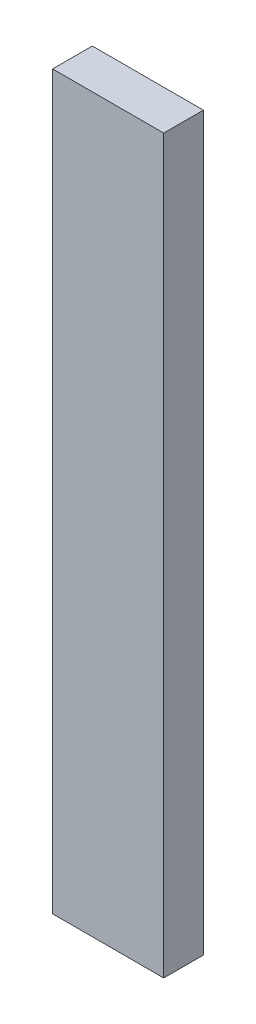
ISO-10303-21;
HEADER;
FILE_DESCRIPTION(('STEP AP214'),'2;1');
FILE_NAME('part.step','',(''),(''),'','','');
FILE_SCHEMA(('AUTOMOTIVE_DESIGN { 1 0 10303 214 1 1 1 1 }'));
ENDSEC;
DATA;
#1=APPLICATION_CONTEXT('core data for automotive mechanical design processes');
#2=APPLICATION_PROTOCOL_DEFINITION('international standard','automotive_design',2000,#1);
#3=PRODUCT_CONTEXT('',#1,'mechanical');
#4=PRODUCT('Part','Part','',(#3));
#5=PRODUCT_RELATED_PRODUCT_CATEGORY('part','',(#4));
#6=PRODUCT_DEFINITION_FORMATION('','',#4);
#7=PRODUCT_DEFINITION_CONTEXT('part definition',#1,'design');
#8=PRODUCT_DEFINITION('design','',#6,#7);
#9=PRODUCT_DEFINITION_SHAPE('','',#8);
#10=(LENGTH_UNIT() NAMED_UNIT(*) SI_UNIT(.MILLI.,.METRE.));
#11=(NAMED_UNIT(*) PLANE_ANGLE_UNIT() SI_UNIT($,.RADIAN.));
#12=(NAMED_UNIT(*) SI_UNIT($,.STERADIAN.) SOLID_ANGLE_UNIT());
#13=UNCERTAINTY_MEASURE_WITH_UNIT(LENGTH_MEASURE(1.E-05),#10,'distance_accuracy_value','');
#14=(GEOMETRIC_REPRESENTATION_CONTEXT(3) GLOBAL_UNCERTAINTY_ASSIGNED_CONTEXT((#13)) GLOBAL_UNIT_ASSIGNED_CONTEXT((#10,
#11,#12)) REPRESENTATION_CONTEXT('',''));
#15=CARTESIAN_POINT('',(0.,0.,0.));
#16=DIRECTION('',(0.,0.,1.));
#17=DIRECTION('',(1.,0.,0.));
#18=AXIS2_PLACEMENT_3D('',#15,#16,#17);
#19=CARTESIAN_POINT('',(0.35,4.61,-0.125));
#20=DIRECTION('',(-1.,0.,0.));
#21=DIRECTION('',(0.,0.,1.));
#22=AXIS2_PLACEMENT_3D('',#19,#20,#21);
#23=PLANE('',#22);
#24=DIRECTION('',(0.,0.,-1.));
#25=VECTOR('',#24,1.);
#26=CARTESIAN_POINT('',(0.35,0.,-0.125));
#27=LINE('',#26,#25);
#28=CARTESIAN_POINT('',(0.35,0.,0.125));
#29=VERTEX_POINT('',#28);
#30=CARTESIAN_POINT('',(0.35,0.,-0.125));
#31=VERTEX_POINT('',#30);
#32=EDGE_CURVE('E114',#29,#31,#27,.T.);
#33=ORIENTED_EDGE('',*,*,#32,.T.);
#34=DIRECTION('',(0.,-1.,0.));
#35=VECTOR('',#34,1.);
#36=CARTESIAN_POINT('',(0.35,4.61,-0.125));
#37=LINE('',#36,#35);
#38=CARTESIAN_POINT('',(0.35,4.61,-0.125));
#39=VERTEX_POINT('',#38);
#40=EDGE_CURVE('E11',#39,#31,#37,.T.);
#41=ORIENTED_EDGE('',*,*,#40,.F.);
#42=DIRECTION('',(0.,0.,-1.));
#43=VECTOR('',#42,1.);
#44=CARTESIAN_POINT('',(0.35,4.61,-0.125));
#45=LINE('',#44,#43);
#46=CARTESIAN_POINT('',(0.35,4.61,0.125));
#47=VERTEX_POINT('',#46);
#48=EDGE_CURVE('E95',#47,#39,#45,.T.);
#49=ORIENTED_EDGE('',*,*,#48,.F.);
#50=DIRECTION('',(0.,-1.,0.));
#51=VECTOR('',#50,1.);
#52=CARTESIAN_POINT('',(0.35,4.61,0.125));
#53=LINE('',#52,#51);
#54=EDGE_CURVE('E110',#47,#29,#53,.T.);
#55=ORIENTED_EDGE('',*,*,#54,.T.);
#56=EDGE_LOOP('',(#33,#41,#49,#55));
#57=FACE_BOUND('',#56,.T.);
#58=ADVANCED_FACE('F43',(#57),#23,.F.);
#59=CARTESIAN_POINT('',(-0.35,4.61,-0.125));
#60=DIRECTION('',(0.,0.,1.));
#61=DIRECTION('',(1.,0.,0.));
#62=AXIS2_PLACEMENT_3D('',#59,#60,#61);
#63=PLANE('',#62);
#64=DIRECTION('',(-1.,0.,0.));
#65=VECTOR('',#64,1.);
#66=CARTESIAN_POINT('',(-0.35,0.,-0.125));
#67=LINE('',#66,#65);
#68=CARTESIAN_POINT('',(-0.35,0.,-0.125));
#69=VERTEX_POINT('',#68);
#70=EDGE_CURVE('E100',#31,#69,#67,.T.);
#71=ORIENTED_EDGE('',*,*,#70,.T.);
#72=DIRECTION('',(0.,-1.,0.));
#73=VECTOR('',#72,1.);
#74=CARTESIAN_POINT('',(-0.35,4.61,-0.125));
#75=LINE('',#74,#73);
#76=CARTESIAN_POINT('',(-0.35,4.61,-0.125));
#77=VERTEX_POINT('',#76);
#78=EDGE_CURVE('E52',#77,#69,#75,.T.);
#79=ORIENTED_EDGE('',*,*,#78,.F.);
#80=DIRECTION('',(-1.,0.,0.));
#81=VECTOR('',#80,1.);
#82=CARTESIAN_POINT('',(-0.35,4.61,-0.125));
#83=LINE('',#82,#81);
#84=EDGE_CURVE('E90',#39,#77,#83,.T.);
#85=ORIENTED_EDGE('',*,*,#84,.F.);
#86=ORIENTED_EDGE('',*,*,#40,.T.);
#87=EDGE_LOOP('',(#71,#79,#85,#86));
#88=FACE_BOUND('',#87,.T.);
#89=ADVANCED_FACE('F99',(#88),#63,.F.);
#90=CARTESIAN_POINT('',(-0.35,4.61,-0.125));
#91=DIRECTION('',(1.,0.,0.));
#92=DIRECTION('',(0.,0.,-1.));
#93=AXIS2_PLACEMENT_3D('',#90,#91,#92);
#94=PLANE('',#93);
#95=DIRECTION('',(0.,0.,1.));
#96=VECTOR('',#95,1.);
#97=CARTESIAN_POINT('',(-0.35,0.,-0.125));
#98=LINE('',#97,#96);
#99=CARTESIAN_POINT('',(-0.35,0.,0.125));
#100=VERTEX_POINT('',#99);
#101=EDGE_CURVE('E77',#69,#100,#98,.T.);
#102=ORIENTED_EDGE('',*,*,#101,.T.);
#103=DIRECTION('',(0.,-1.,0.));
#104=VECTOR('',#103,1.);
#105=CARTESIAN_POINT('',(-0.35,4.61,0.125));
#106=LINE('',#105,#104);
#107=CARTESIAN_POINT('',(-0.35,4.61,0.125));
#108=VERTEX_POINT('',#107);
#109=EDGE_CURVE('E102',#108,#100,#106,.T.);
#110=ORIENTED_EDGE('',*,*,#109,.F.);
#111=DIRECTION('',(0.,0.,1.));
#112=VECTOR('',#111,1.);
#113=CARTESIAN_POINT('',(-0.35,4.61,-0.125));
#114=LINE('',#113,#112);
#115=EDGE_CURVE('E93',#77,#108,#114,.T.);
#116=ORIENTED_EDGE('',*,*,#115,.F.);
#117=ORIENTED_EDGE('',*,*,#78,.T.);
#118=EDGE_LOOP('',(#102,#110,#116,#117));
#119=FACE_BOUND('',#118,.T.);
#120=ADVANCED_FACE('F103',(#119),#94,.F.);
#121=CARTESIAN_POINT('',(-0.35,4.61,0.125));
#122=DIRECTION('',(0.,0.,-1.));
#123=DIRECTION('',(-1.,0.,0.));
#124=AXIS2_PLACEMENT_3D('',#121,#122,#123);
#125=PLANE('',#124);
#126=DIRECTION('',(1.,0.,0.));
#127=VECTOR('',#126,1.);
#128=CARTESIAN_POINT('',(-0.35,0.,0.125));
#129=LINE('',#128,#127);
#130=EDGE_CURVE('E83',#100,#29,#129,.T.);
#131=ORIENTED_EDGE('',*,*,#130,.T.);
#132=ORIENTED_EDGE('',*,*,#54,.F.);
#133=DIRECTION('',(1.,0.,0.));
#134=VECTOR('',#133,1.);
#135=CARTESIAN_POINT('',(-0.35,4.61,0.125));
#136=LINE('',#135,#134);
#137=EDGE_CURVE('E60',#108,#47,#136,.T.);
#138=ORIENTED_EDGE('',*,*,#137,.F.);
#139=ORIENTED_EDGE('',*,*,#109,.T.);
#140=EDGE_LOOP('',(#131,#132,#138,#139));
#141=FACE_BOUND('',#140,.T.);
#142=ADVANCED_FACE('F126',(#141),#125,.F.);
#143=CARTESIAN_POINT('',(0.,4.61,0.));
#144=DIRECTION('',(0.,1.,0.));
#145=DIRECTION('',(0.,0.,1.));
#146=AXIS2_PLACEMENT_3D('',#143,#144,#145);
#147=PLANE('',#146);
#148=ORIENTED_EDGE('',*,*,#48,.T.);
#149=ORIENTED_EDGE('',*,*,#84,.T.);
#150=ORIENTED_EDGE('',*,*,#115,.T.);
#151=ORIENTED_EDGE('',*,*,#137,.T.);
#152=EDGE_LOOP('',(#148,#149,#150,#151));
#153=FACE_BOUND('',#152,.T.);
#154=ADVANCED_FACE('F91',(#153),#147,.T.);
#155=CARTESIAN_POINT('',(0.,0.,0.));
#156=DIRECTION('',(0.,1.,0.));
#157=DIRECTION('',(0.,0.,1.));
#158=AXIS2_PLACEMENT_3D('',#155,#156,#157);
#159=PLANE('',#158);
#160=ORIENTED_EDGE('',*,*,#32,.F.);
#161=ORIENTED_EDGE('',*,*,#130,.F.);
#162=ORIENTED_EDGE('',*,*,#101,.F.);
#163=ORIENTED_EDGE('',*,*,#70,.F.);
#164=EDGE_LOOP('',(#160,#161,#162,#163));
#165=FACE_BOUND('',#164,.T.);
#166=ADVANCED_FACE('F129',(#165),#159,.F.);
#167=CLOSED_SHELL('',(#58,#89,#120,#142,#154,#166));
#168=MANIFOLD_SOLID_BREP('B2',#167);
#169=ADVANCED_BREP_SHAPE_REPRESENTATION('',(#18,#168),#14);
#170=SHAPE_DEFINITION_REPRESENTATION(#9,#169);
ENDSEC;
END-ISO-10303-21;
